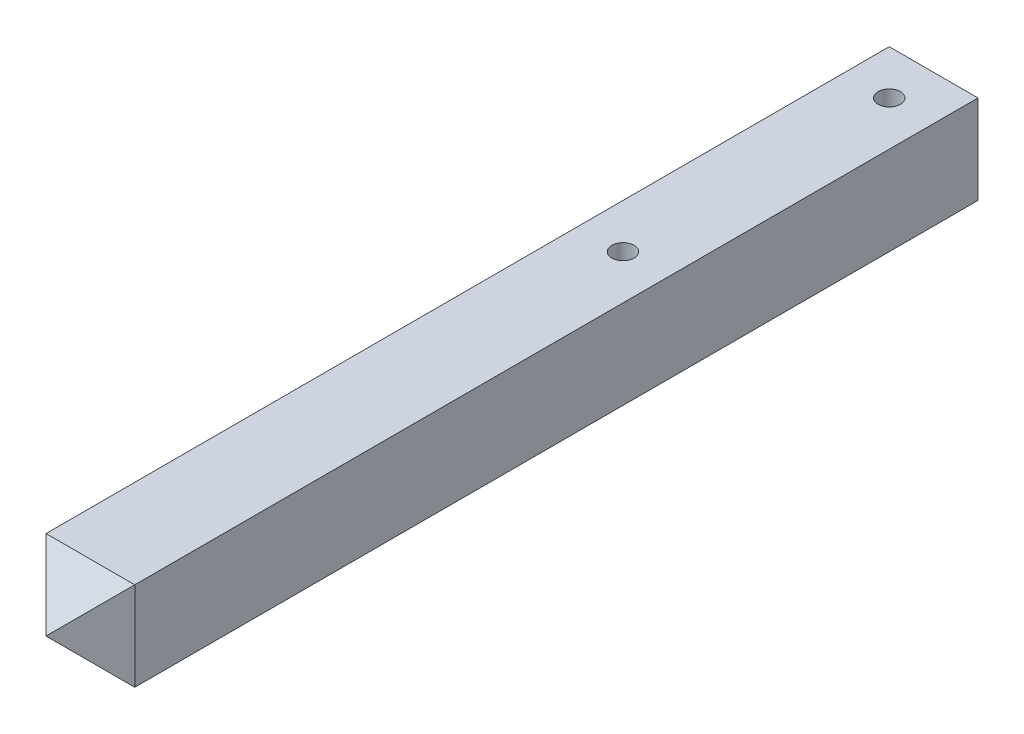
ISO-10303-21;
HEADER;
FILE_DESCRIPTION(('STEP AP214'),'2;1');
FILE_NAME('part.step','',(''),(''),'','','');
FILE_SCHEMA(('AUTOMOTIVE_DESIGN { 1 0 10303 214 1 1 1 1 }'));
ENDSEC;
DATA;
#1=APPLICATION_CONTEXT('core data for automotive mechanical design processes');
#2=APPLICATION_PROTOCOL_DEFINITION('international standard','automotive_design',2000,#1);
#3=PRODUCT_CONTEXT('',#1,'mechanical');
#4=PRODUCT('Part','Part','',(#3));
#5=PRODUCT_RELATED_PRODUCT_CATEGORY('part','',(#4));
#6=PRODUCT_DEFINITION_FORMATION('','',#4);
#7=PRODUCT_DEFINITION_CONTEXT('part definition',#1,'design');
#8=PRODUCT_DEFINITION('design','',#6,#7);
#9=PRODUCT_DEFINITION_SHAPE('','',#8);
#10=(LENGTH_UNIT() NAMED_UNIT(*) SI_UNIT(.MILLI.,.METRE.));
#11=(NAMED_UNIT(*) PLANE_ANGLE_UNIT() SI_UNIT($,.RADIAN.));
#12=(NAMED_UNIT(*) SI_UNIT($,.STERADIAN.) SOLID_ANGLE_UNIT());
#13=UNCERTAINTY_MEASURE_WITH_UNIT(LENGTH_MEASURE(1.E-05),#10,'distance_accuracy_value','');
#14=(GEOMETRIC_REPRESENTATION_CONTEXT(3) GLOBAL_UNCERTAINTY_ASSIGNED_CONTEXT((#13)) GLOBAL_UNIT_ASSIGNED_CONTEXT((#10,
#11,#12)) REPRESENTATION_CONTEXT('',''));
#15=CARTESIAN_POINT('',(0.,0.,0.));
#16=DIRECTION('',(0.,0.,1.));
#17=DIRECTION('',(1.,0.,0.));
#18=AXIS2_PLACEMENT_3D('',#15,#16,#17);
#19=CARTESIAN_POINT('',(-65.0000000000001,85.,-632.206861013499));
#20=DIRECTION('',(0.,1.,0.));
#21=DIRECTION('',(0.,0.,1.));
#22=AXIS2_PLACEMENT_3D('',#19,#20,#21);
#23=PLANE('',#22);
#24=CARTESIAN_POINT('',(9.99999999999993,85.,-557.206861013499));
#25=DIRECTION('',(0.,1.,0.));
#26=DIRECTION('',(0.,0.,1.));
#27=AXIS2_PLACEMENT_3D('',#24,#25,#26);
#28=CIRCLE('',#27,18.75);
#29=CARTESIAN_POINT('',(9.99999999999993,85.,-538.456861013499));
#30=VERTEX_POINT('',#29);
#31=EDGE_CURVE('E114',#30,#30,#28,.T.);
#32=ORIENTED_EDGE('',*,*,#31,.F.);
#33=EDGE_LOOP('',(#32));
#34=FACE_BOUND('',#33,.T.);
#35=DIRECTION('',(0.,0.,1.));
#36=VECTOR('',#35,1.);
#37=CARTESIAN_POINT('',(-65.0000000000001,85.,-632.206861013499));
#38=LINE('',#37,#36);
#39=CARTESIAN_POINT('',(-65.0000000000001,85.,-632.206861013499));
#40=VERTEX_POINT('',#39);
#41=CARTESIAN_POINT('',(-64.9999999999999,85.,792.793138986501));
#42=VERTEX_POINT('',#41);
#43=EDGE_CURVE('E90',#40,#42,#38,.T.);
#44=ORIENTED_EDGE('',*,*,#43,.T.);
#45=DIRECTION('',(1.,0.,0.));
#46=VECTOR('',#45,1.);
#47=CARTESIAN_POINT('',(85.0000000000001,85.,792.793138986501));
#48=LINE('',#47,#46);
#49=CARTESIAN_POINT('',(85.0000000000001,85.,792.793138986501));
#50=VERTEX_POINT('',#49);
#51=EDGE_CURVE('E11',#42,#50,#48,.T.);
#52=ORIENTED_EDGE('',*,*,#51,.T.);
#53=DIRECTION('',(0.,0.,-1.));
#54=VECTOR('',#53,1.);
#55=CARTESIAN_POINT('',(84.9999999999999,85.,-632.206861013499));
#56=LINE('',#55,#54);
#57=CARTESIAN_POINT('',(84.9999999999999,85.,-632.206861013499));
#58=VERTEX_POINT('',#57);
#59=EDGE_CURVE('E79',#50,#58,#56,.T.);
#60=ORIENTED_EDGE('',*,*,#59,.T.);
#61=DIRECTION('',(-1.,0.,0.));
#62=VECTOR('',#61,1.);
#63=CARTESIAN_POINT('',(-65.0000000000001,85.,-632.206861013499));
#64=LINE('',#63,#62);
#65=EDGE_CURVE('E83',#58,#40,#64,.T.);
#66=ORIENTED_EDGE('',*,*,#65,.T.);
#67=EDGE_LOOP('',(#44,#52,#60,#66));
#68=FACE_BOUND('',#67,.T.);
#69=CARTESIAN_POINT('',(9.99999999999993,85.,-107.206861013499));
#70=DIRECTION('',(0.,1.,0.));
#71=DIRECTION('',(0.,0.,1.));
#72=AXIS2_PLACEMENT_3D('',#69,#70,#71);
#73=CIRCLE('',#72,18.75);
#74=CARTESIAN_POINT('',(9.99999999999993,85.,-88.4568610134992));
#75=VERTEX_POINT('',#74);
#76=EDGE_CURVE('E147',#75,#75,#73,.T.);
#77=ORIENTED_EDGE('',*,*,#76,.F.);
#78=EDGE_LOOP('',(#77));
#79=FACE_BOUND('',#78,.T.);
#80=ADVANCED_FACE('F38',(#34,#68,#79),#23,.T.);
#81=CARTESIAN_POINT('',(-65.0000000000001,-65.,-632.206861013499));
#82=DIRECTION('',(0.,1.,0.));
#83=DIRECTION('',(0.,0.,1.));
#84=AXIS2_PLACEMENT_3D('',#81,#82,#83);
#85=PLANE('',#84);
#86=CARTESIAN_POINT('',(9.99999999999993,-65.,-557.206861013499));
#87=DIRECTION('',(0.,1.,0.));
#88=DIRECTION('',(0.,0.,1.));
#89=AXIS2_PLACEMENT_3D('',#86,#87,#88);
#90=CIRCLE('',#89,18.75);
#91=CARTESIAN_POINT('',(9.99999999999993,-65.,-538.456861013499));
#92=VERTEX_POINT('',#91);
#93=EDGE_CURVE('E153',#92,#92,#90,.T.);
#94=ORIENTED_EDGE('',*,*,#93,.T.);
#95=EDGE_LOOP('',(#94));
#96=FACE_BOUND('',#95,.T.);
#97=DIRECTION('',(0.,0.,-1.));
#98=VECTOR('',#97,1.);
#99=CARTESIAN_POINT('',(84.9999999999999,-65.,-632.206861013499));
#100=LINE('',#99,#98);
#101=CARTESIAN_POINT('',(85.0000000000001,-65.,792.793138986501));
#102=VERTEX_POINT('',#101);
#103=CARTESIAN_POINT('',(84.9999999999999,-65.,-632.206861013499));
#104=VERTEX_POINT('',#103);
#105=EDGE_CURVE('E96',#102,#104,#100,.T.);
#106=ORIENTED_EDGE('',*,*,#105,.F.);
#107=DIRECTION('',(-1.,0.,0.));
#108=VECTOR('',#107,1.);
#109=CARTESIAN_POINT('',(-65.0000000000001,-65.,792.793138986501));
#110=LINE('',#109,#108);
#111=CARTESIAN_POINT('',(-64.9999999999999,-65.,792.793138986501));
#112=VERTEX_POINT('',#111);
#113=EDGE_CURVE('E122',#102,#112,#110,.T.);
#114=ORIENTED_EDGE('',*,*,#113,.T.);
#115=DIRECTION('',(0.,0.,1.));
#116=VECTOR('',#115,1.);
#117=CARTESIAN_POINT('',(-65.0000000000001,-65.,-632.206861013499));
#118=LINE('',#117,#116);
#119=CARTESIAN_POINT('',(-65.0000000000001,-65.,-632.206861013499));
#120=VERTEX_POINT('',#119);
#121=EDGE_CURVE('E111',#120,#112,#118,.T.);
#122=ORIENTED_EDGE('',*,*,#121,.F.);
#123=DIRECTION('',(-1.,0.,0.));
#124=VECTOR('',#123,1.);
#125=CARTESIAN_POINT('',(-65.0000000000001,-65.,-632.206861013499));
#126=LINE('',#125,#124);
#127=EDGE_CURVE('E117',#104,#120,#126,.T.);
#128=ORIENTED_EDGE('',*,*,#127,.F.);
#129=EDGE_LOOP('',(#106,#114,#122,#128));
#130=FACE_BOUND('',#129,.T.);
#131=CARTESIAN_POINT('',(9.99999999999993,-65.,-107.206861013499));
#132=DIRECTION('',(0.,1.,0.));
#133=DIRECTION('',(0.,0.,1.));
#134=AXIS2_PLACEMENT_3D('',#131,#132,#133);
#135=CIRCLE('',#134,18.75);
#136=CARTESIAN_POINT('',(9.99999999999993,-65.,-88.4568610134992));
#137=VERTEX_POINT('',#136);
#138=EDGE_CURVE('E142',#137,#137,#135,.T.);
#139=ORIENTED_EDGE('',*,*,#138,.T.);
#140=EDGE_LOOP('',(#139));
#141=FACE_BOUND('',#140,.T.);
#142=ADVANCED_FACE('F168',(#96,#130,#141),#85,.F.);
#143=CARTESIAN_POINT('',(-65.0000000000001,85.,-632.206861013499));
#144=DIRECTION('',(1.,0.,0.));
#145=DIRECTION('',(0.,0.,-1.));
#146=AXIS2_PLACEMENT_3D('',#143,#144,#145);
#147=PLANE('',#146);
#148=ORIENTED_EDGE('',*,*,#121,.T.);
#149=DIRECTION('',(0.,1.,0.));
#150=VECTOR('',#149,1.);
#151=CARTESIAN_POINT('',(-64.9999999999999,85.,792.793138986501));
#152=LINE('',#151,#150);
#153=EDGE_CURVE('E49',#112,#42,#152,.T.);
#154=ORIENTED_EDGE('',*,*,#153,.T.);
#155=ORIENTED_EDGE('',*,*,#43,.F.);
#156=DIRECTION('',(0.,-1.,0.));
#157=VECTOR('',#156,1.);
#158=CARTESIAN_POINT('',(-65.0000000000001,85.,-632.206861013499));
#159=LINE('',#158,#157);
#160=EDGE_CURVE('E101',#40,#120,#159,.T.);
#161=ORIENTED_EDGE('',*,*,#160,.T.);
#162=EDGE_LOOP('',(#148,#154,#155,#161));
#163=FACE_BOUND('',#162,.T.);
#164=ADVANCED_FACE('F170',(#163),#147,.F.);
#165=CARTESIAN_POINT('',(84.9999999999999,85.,-632.206861013499));
#166=DIRECTION('',(-1.,0.,0.));
#167=DIRECTION('',(0.,0.,1.));
#168=AXIS2_PLACEMENT_3D('',#165,#166,#167);
#169=PLANE('',#168);
#170=ORIENTED_EDGE('',*,*,#59,.F.);
#171=DIRECTION('',(0.,-1.,0.));
#172=VECTOR('',#171,1.);
#173=CARTESIAN_POINT('',(85.0000000000001,85.,792.793138986501));
#174=LINE('',#173,#172);
#175=EDGE_CURVE('E100',#50,#102,#174,.T.);
#176=ORIENTED_EDGE('',*,*,#175,.T.);
#177=ORIENTED_EDGE('',*,*,#105,.T.);
#178=DIRECTION('',(0.,-1.,0.));
#179=VECTOR('',#178,1.);
#180=CARTESIAN_POINT('',(84.9999999999999,85.,-632.206861013499));
#181=LINE('',#180,#179);
#182=EDGE_CURVE('E93',#58,#104,#181,.T.);
#183=ORIENTED_EDGE('',*,*,#182,.F.);
#184=EDGE_LOOP('',(#170,#176,#177,#183));
#185=FACE_BOUND('',#184,.T.);
#186=ADVANCED_FACE('F94',(#185),#169,.F.);
#187=CARTESIAN_POINT('',(-65.0000000000001,85.,-632.206861013499));
#188=DIRECTION('',(0.,0.,1.));
#189=DIRECTION('',(1.,0.,0.));
#190=AXIS2_PLACEMENT_3D('',#187,#188,#189);
#191=PLANE('',#190);
#192=ORIENTED_EDGE('',*,*,#127,.T.);
#193=ORIENTED_EDGE('',*,*,#160,.F.);
#194=ORIENTED_EDGE('',*,*,#65,.F.);
#195=ORIENTED_EDGE('',*,*,#182,.T.);
#196=EDGE_LOOP('',(#192,#193,#194,#195));
#197=FACE_BOUND('',#196,.T.);
#198=ADVANCED_FACE('F103',(#197),#191,.F.);
#199=CARTESIAN_POINT('',(9.99999999999993,85.,-557.206861013499));
#200=DIRECTION('',(0.,-1.,0.));
#201=DIRECTION('',(0.,0.,-1.));
#202=AXIS2_PLACEMENT_3D('',#199,#200,#201);
#203=CYLINDRICAL_SURFACE('',#202,18.75);
#204=ORIENTED_EDGE('',*,*,#31,.T.);
#205=EDGE_LOOP('',(#204));
#206=FACE_BOUND('',#205,.T.);
#207=ORIENTED_EDGE('',*,*,#93,.F.);
#208=EDGE_LOOP('',(#207));
#209=FACE_BOUND('',#208,.T.);
#210=ADVANCED_FACE('F188',(#206,#209),#203,.F.);
#211=CARTESIAN_POINT('',(9.99999999999993,85.,-107.206861013499));
#212=DIRECTION('',(0.,-1.,0.));
#213=DIRECTION('',(0.,0.,-1.));
#214=AXIS2_PLACEMENT_3D('',#211,#212,#213);
#215=CYLINDRICAL_SURFACE('',#214,18.75);
#216=ORIENTED_EDGE('',*,*,#76,.T.);
#217=EDGE_LOOP('',(#216));
#218=FACE_BOUND('',#217,.T.);
#219=ORIENTED_EDGE('',*,*,#138,.F.);
#220=EDGE_LOOP('',(#219));
#221=FACE_BOUND('',#220,.T.);
#222=ADVANCED_FACE('F195',(#218,#221),#215,.F.);
#223=CARTESIAN_POINT('',(10.0000000000002,85.,867.793138986501));
#224=DIRECTION('',(0.707106781186546,0.,-0.707106781186548));
#225=DIRECTION('',(0.,-1.,0.));
#226=AXIS2_PLACEMENT_3D('',#223,#224,#225);
#227=PLANE('',#226);
#228=DIRECTION('',(-0.577350269189626,0.577350269189626,-0.577350269189625));
#229=VECTOR('',#228,1.);
#230=CARTESIAN_POINT('',(-65.,85.0000000000001,792.793138986501));
#231=LINE('',#230,#229);
#232=CARTESIAN_POINT('',(10.,10.0000000000001,867.793138986501));
#233=VERTEX_POINT('',#232);
#234=EDGE_CURVE('E42',#42,#233,#231,.F.);
#235=ORIENTED_EDGE('',*,*,#234,.F.);
#236=ORIENTED_EDGE('',*,*,#153,.F.);
#237=DIRECTION('',(0.577350269189626,0.577350269189626,0.577350269189625));
#238=VECTOR('',#237,1.);
#239=CARTESIAN_POINT('',(35.0000000000002,35.0000000000001,892.793138986501));
#240=LINE('',#239,#238);
#241=EDGE_CURVE('E133',#233,#112,#240,.F.);
#242=ORIENTED_EDGE('',*,*,#241,.F.);
#243=EDGE_LOOP('',(#235,#236,#242));
#244=FACE_BOUND('',#243,.T.);
#245=ADVANCED_FACE('F40',(#244),#227,.F.);
#246=CARTESIAN_POINT('',(-65.0000000000001,85.,792.793138986501));
#247=DIRECTION('',(0.,0.707106781186546,0.707106781186548));
#248=DIRECTION('',(-1.,0.,0.));
#249=AXIS2_PLACEMENT_3D('',#246,#247,#248);
#250=PLANE('',#249);
#251=ORIENTED_EDGE('',*,*,#51,.F.);
#252=ORIENTED_EDGE('',*,*,#234,.T.);
#253=DIRECTION('',(-0.577350269189626,-0.577350269189626,0.577350269189625));
#254=VECTOR('',#253,1.);
#255=CARTESIAN_POINT('',(34.9999999999999,34.9999999999998,842.793138986501));
#256=LINE('',#255,#254);
#257=EDGE_CURVE('E130',#50,#233,#256,.T.);
#258=ORIENTED_EDGE('',*,*,#257,.F.);
#259=EDGE_LOOP('',(#251,#252,#258));
#260=FACE_BOUND('',#259,.T.);
#261=ADVANCED_FACE('F163',(#260),#250,.T.);
#262=CARTESIAN_POINT('',(-64.9999999999999,10.0000000000001,867.793138986501));
#263=DIRECTION('',(0.,0.707106781186546,-0.707106781186548));
#264=DIRECTION('',(1.,0.,0.));
#265=AXIS2_PLACEMENT_3D('',#262,#263,#264);
#266=PLANE('',#265);
#267=ORIENTED_EDGE('',*,*,#241,.T.);
#268=ORIENTED_EDGE('',*,*,#113,.F.);
#269=DIRECTION('',(-0.577350269189626,0.577350269189626,0.577350269189625));
#270=VECTOR('',#269,1.);
#271=CARTESIAN_POINT('',(-15.,35.0000000000001,892.793138986501));
#272=LINE('',#271,#270);
#273=EDGE_CURVE('E127',#233,#102,#272,.F.);
#274=ORIENTED_EDGE('',*,*,#273,.F.);
#275=EDGE_LOOP('',(#267,#268,#274));
#276=FACE_BOUND('',#275,.T.);
#277=ADVANCED_FACE('F211',(#276),#266,.F.);
#278=CARTESIAN_POINT('',(85.0000000000001,85.,792.793138986501));
#279=DIRECTION('',(-0.707106781186546,0.,-0.707106781186549));
#280=DIRECTION('',(0.,-1.,0.));
#281=AXIS2_PLACEMENT_3D('',#278,#279,#280);
#282=PLANE('',#281);
#283=ORIENTED_EDGE('',*,*,#175,.F.);
#284=ORIENTED_EDGE('',*,*,#257,.T.);
#285=ORIENTED_EDGE('',*,*,#273,.T.);
#286=EDGE_LOOP('',(#283,#284,#285));
#287=FACE_BOUND('',#286,.T.);
#288=ADVANCED_FACE('F166',(#287),#282,.F.);
#289=CLOSED_SHELL('',(#80,#142,#164,#186,#198,#210,#222,#245,#261,#277,#288));
#290=MANIFOLD_SOLID_BREP('B2',#289);
#291=ADVANCED_BREP_SHAPE_REPRESENTATION('',(#18,#290),#14);
#292=SHAPE_DEFINITION_REPRESENTATION(#9,#291);
ENDSEC;
END-ISO-10303-21;
